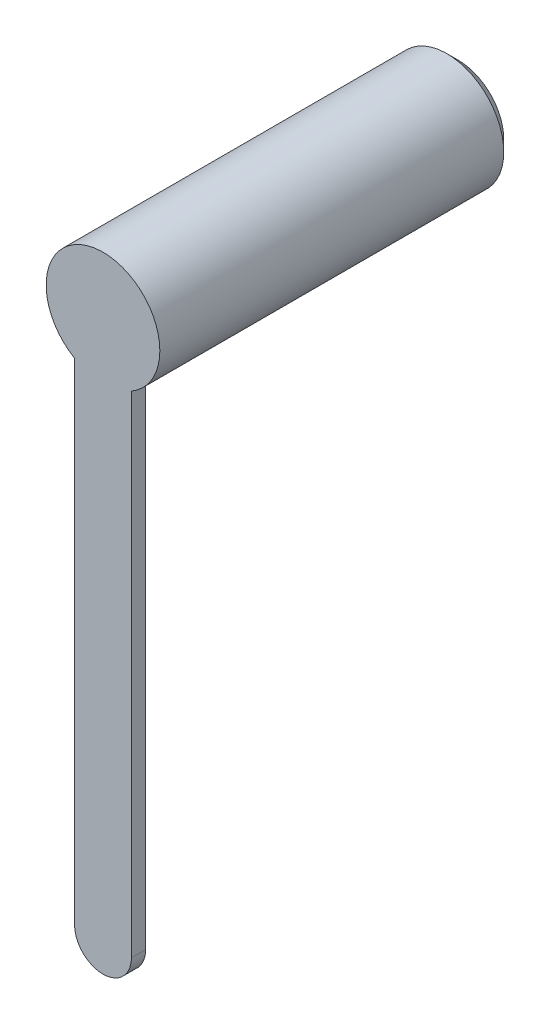
ISO-10303-21;
HEADER;
FILE_DESCRIPTION(('STEP AP214'),'2;1');
FILE_NAME('part.step','',(''),(''),'','','');
FILE_SCHEMA(('AUTOMOTIVE_DESIGN { 1 0 10303 214 1 1 1 1 }'));
ENDSEC;
DATA;
#1=APPLICATION_CONTEXT('core data for automotive mechanical design processes');
#2=APPLICATION_PROTOCOL_DEFINITION('international standard','automotive_design',2000,#1);
#3=PRODUCT_CONTEXT('',#1,'mechanical');
#4=PRODUCT('Part','Part','',(#3));
#5=PRODUCT_RELATED_PRODUCT_CATEGORY('part','',(#4));
#6=PRODUCT_DEFINITION_FORMATION('','',#4);
#7=PRODUCT_DEFINITION_CONTEXT('part definition',#1,'design');
#8=PRODUCT_DEFINITION('design','',#6,#7);
#9=PRODUCT_DEFINITION_SHAPE('','',#8);
#10=(LENGTH_UNIT() NAMED_UNIT(*) SI_UNIT(.MILLI.,.METRE.));
#11=(NAMED_UNIT(*) PLANE_ANGLE_UNIT() SI_UNIT($,.RADIAN.));
#12=(NAMED_UNIT(*) SI_UNIT($,.STERADIAN.) SOLID_ANGLE_UNIT());
#13=UNCERTAINTY_MEASURE_WITH_UNIT(LENGTH_MEASURE(1.E-05),#10,'distance_accuracy_value','');
#14=(GEOMETRIC_REPRESENTATION_CONTEXT(3) GLOBAL_UNCERTAINTY_ASSIGNED_CONTEXT((#13)) GLOBAL_UNIT_ASSIGNED_CONTEXT((#10,
#11,#12)) REPRESENTATION_CONTEXT('',''));
#15=CARTESIAN_POINT('',(0.,0.,0.));
#16=DIRECTION('',(0.,0.,1.));
#17=DIRECTION('',(1.,0.,0.));
#18=AXIS2_PLACEMENT_3D('',#15,#16,#17);
#19=CARTESIAN_POINT('',(0.,6.5,0.125));
#20=DIRECTION('',(0.,0.,1.));
#21=DIRECTION('',(1.,0.,0.));
#22=AXIS2_PLACEMENT_3D('',#19,#20,#21);
#23=PLANE('',#22);
#24=DIRECTION('',(0.,1.,0.));
#25=VECTOR('',#24,1.);
#26=CARTESIAN_POINT('',(0.500000000010001,-3.00000000001,0.12500000001));
#27=LINE('',#26,#25);
#28=CARTESIAN_POINT('',(0.5,-3.,0.125));
#29=VERTEX_POINT('',#28);
#30=CARTESIAN_POINT('',(0.5,5.63397459621556,0.125));
#31=VERTEX_POINT('',#30);
#32=EDGE_CURVE('E93',#29,#31,#27,.T.);
#33=ORIENTED_EDGE('',*,*,#32,.T.);
#34=CARTESIAN_POINT('',(0.,6.50000000001,0.12500000001));
#35=DIRECTION('',(0.,0.,1.));
#36=DIRECTION('',(1.,0.,0.));
#37=AXIS2_PLACEMENT_3D('',#34,#35,#36);
#38=CIRCLE('',#37,1.);
#39=CARTESIAN_POINT('',(-0.5,5.63397459621556,0.125));
#40=VERTEX_POINT('',#39);
#41=EDGE_CURVE('E90',#31,#40,#38,.T.);
#42=ORIENTED_EDGE('',*,*,#41,.T.);
#43=DIRECTION('',(0.,-1.,0.));
#44=VECTOR('',#43,1.);
#45=CARTESIAN_POINT('',(-0.500000000010001,5.63397459622556,0.12500000001));
#46=LINE('',#45,#44);
#47=CARTESIAN_POINT('',(-0.5,-3.,0.125));
#48=VERTEX_POINT('',#47);
#49=EDGE_CURVE('E91',#40,#48,#46,.T.);
#50=ORIENTED_EDGE('',*,*,#49,.T.);
#51=CARTESIAN_POINT('',(0.,-3.00000000001,0.12500000001));
#52=DIRECTION('',(0.,0.,1.));
#53=DIRECTION('',(1.,0.,0.));
#54=AXIS2_PLACEMENT_3D('',#51,#52,#53);
#55=CIRCLE('',#54,0.5);
#56=EDGE_CURVE('E11',#48,#29,#55,.T.);
#57=ORIENTED_EDGE('',*,*,#56,.T.);
#58=EDGE_LOOP('',(#33,#42,#50,#57));
#59=FACE_BOUND('',#58,.T.);
#60=ADVANCED_FACE('F17',(#59),#23,.T.);
#61=CARTESIAN_POINT('',(0.,-3.,0.125));
#62=DIRECTION('',(0.,0.,1.));
#63=DIRECTION('',(-1.,0.,0.));
#64=AXIS2_PLACEMENT_3D('',#61,#62,#63);
#65=CYLINDRICAL_SURFACE('',#64,0.5);
#66=CARTESIAN_POINT('',(0.,-3.00000000001,-0.12500000001));
#67=DIRECTION('',(0.,0.,1.));
#68=DIRECTION('',(1.,0.,0.));
#69=AXIS2_PLACEMENT_3D('',#66,#67,#68);
#70=CIRCLE('',#69,0.5);
#71=CARTESIAN_POINT('',(-0.5,-3.,-0.125));
#72=VERTEX_POINT('',#71);
#73=CARTESIAN_POINT('',(0.5,-3.,-0.125));
#74=VERTEX_POINT('',#73);
#75=EDGE_CURVE('E113',#72,#74,#70,.T.);
#76=ORIENTED_EDGE('',*,*,#75,.T.);
#77=DIRECTION('',(0.,0.,-1.));
#78=VECTOR('',#77,1.);
#79=CARTESIAN_POINT('',(0.500000000010001,-3.00000000001,0.12500000001));
#80=LINE('',#79,#78);
#81=EDGE_CURVE('E28',#29,#74,#80,.T.);
#82=ORIENTED_EDGE('',*,*,#81,.F.);
#83=ORIENTED_EDGE('',*,*,#56,.F.);
#84=DIRECTION('',(0.,0.,-1.));
#85=VECTOR('',#84,1.);
#86=CARTESIAN_POINT('',(-0.500000000010001,-3.00000000001,0.12500000001));
#87=LINE('',#86,#85);
#88=EDGE_CURVE('E72',#48,#72,#87,.T.);
#89=ORIENTED_EDGE('',*,*,#88,.T.);
#90=EDGE_LOOP('',(#76,#82,#83,#89));
#91=FACE_BOUND('',#90,.T.);
#92=ADVANCED_FACE('F184',(#91),#65,.T.);
#93=CARTESIAN_POINT('',(0.5,-3.,0.125));
#94=DIRECTION('',(-1.,0.,0.));
#95=DIRECTION('',(0.,0.,1.));
#96=AXIS2_PLACEMENT_3D('',#93,#94,#95);
#97=PLANE('',#96);
#98=DIRECTION('',(0.,1.,0.));
#99=VECTOR('',#98,1.);
#100=CARTESIAN_POINT('',(0.500000000010001,-3.00000000001,-0.12500000001));
#101=LINE('',#100,#99);
#102=CARTESIAN_POINT('',(0.5,5.63397459621556,-0.125));
#103=VERTEX_POINT('',#102);
#104=EDGE_CURVE('E117',#74,#103,#101,.T.);
#105=ORIENTED_EDGE('',*,*,#104,.T.);
#106=DIRECTION('',(0.,0.,-1.));
#107=VECTOR('',#106,1.);
#108=CARTESIAN_POINT('',(0.500000000010001,5.63397459622556,0.12500000001));
#109=LINE('',#108,#107);
#110=EDGE_CURVE('E97',#31,#103,#109,.T.);
#111=ORIENTED_EDGE('',*,*,#110,.F.);
#112=ORIENTED_EDGE('',*,*,#32,.F.);
#113=ORIENTED_EDGE('',*,*,#81,.T.);
#114=EDGE_LOOP('',(#105,#111,#112,#113));
#115=FACE_BOUND('',#114,.T.);
#116=ADVANCED_FACE('F180',(#115),#97,.F.);
#117=CARTESIAN_POINT('',(0.,6.5,-0.125));
#118=DIRECTION('',(0.,0.,-1.));
#119=DIRECTION('',(1.,0.,0.));
#120=AXIS2_PLACEMENT_3D('',#117,#118,#119);
#121=CYLINDRICAL_SURFACE('',#120,1.);
#122=ORIENTED_EDGE('',*,*,#41,.F.);
#123=ORIENTED_EDGE('',*,*,#110,.T.);
#124=CARTESIAN_POINT('',(0.,6.50000000001,-0.12500000001));
#125=DIRECTION('',(0.,0.,1.));
#126=DIRECTION('',(1.,0.,0.));
#127=AXIS2_PLACEMENT_3D('',#124,#125,#126);
#128=CIRCLE('',#127,1.);
#129=CARTESIAN_POINT('',(-0.5,5.63397459621556,-0.125));
#130=VERTEX_POINT('',#129);
#131=EDGE_CURVE('E101',#130,#103,#128,.T.);
#132=ORIENTED_EDGE('',*,*,#131,.F.);
#133=DIRECTION('',(0.,0.,-1.));
#134=VECTOR('',#133,1.);
#135=CARTESIAN_POINT('',(-0.500000000010001,5.63397459622556,0.12500000001));
#136=LINE('',#135,#134);
#137=EDGE_CURVE('E60',#40,#130,#136,.T.);
#138=ORIENTED_EDGE('',*,*,#137,.F.);
#139=EDGE_LOOP('',(#122,#123,#132,#138));
#140=FACE_BOUND('',#139,.T.);
#141=CARTESIAN_POINT('',(0.,6.50000000001,-5.92500000001));
#142=DIRECTION('',(0.,0.,1.));
#143=DIRECTION('',(1.,0.,0.));
#144=AXIS2_PLACEMENT_3D('',#141,#142,#143);
#145=CIRCLE('',#144,1.);
#146=CARTESIAN_POINT('',(1.00000000001,6.50000000001,-5.92500000001));
#147=VERTEX_POINT('',#146);
#148=EDGE_CURVE('E21',#147,#147,#145,.T.);
#149=ORIENTED_EDGE('',*,*,#148,.T.);
#150=EDGE_LOOP('',(#149));
#151=FACE_BOUND('',#150,.T.);
#152=ADVANCED_FACE('F19',(#140,#151),#121,.T.);
#153=CARTESIAN_POINT('',(0.,6.5,-5.925));
#154=DIRECTION('',(0.,0.,1.));
#155=DIRECTION('',(1.,0.,0.));
#156=AXIS2_PLACEMENT_3D('',#153,#154,#155);
#157=CONICAL_SURFACE('',#156,1.,0.7853981634);
#158=CARTESIAN_POINT('',(0.,6.50000000001,-6.12500000001));
#159=DIRECTION('',(0.,0.,1.));
#160=DIRECTION('',(1.,0.,0.));
#161=AXIS2_PLACEMENT_3D('',#158,#159,#160);
#162=CIRCLE('',#161,0.8);
#163=CARTESIAN_POINT('',(0.800000000010001,6.50000000001,-6.12500000001));
#164=VERTEX_POINT('',#163);
#165=EDGE_CURVE('E104',#164,#164,#162,.T.);
#166=ORIENTED_EDGE('',*,*,#165,.T.);
#167=EDGE_LOOP('',(#166));
#168=FACE_BOUND('',#167,.T.);
#169=ORIENTED_EDGE('',*,*,#148,.F.);
#170=EDGE_LOOP('',(#169));
#171=FACE_BOUND('',#170,.T.);
#172=ADVANCED_FACE('F224',(#168,#171),#157,.T.);
#173=CARTESIAN_POINT('',(0.,6.5,-6.125));
#174=DIRECTION('',(0.,0.,-1.));
#175=DIRECTION('',(0.,-1.,0.));
#176=AXIS2_PLACEMENT_3D('',#173,#174,#175);
#177=PLANE('',#176);
#178=ORIENTED_EDGE('',*,*,#165,.F.);
#179=EDGE_LOOP('',(#178));
#180=FACE_BOUND('',#179,.T.);
#181=ADVANCED_FACE('F209',(#180),#177,.T.);
#182=CARTESIAN_POINT('',(-0.5,5.63397459621556,0.125));
#183=DIRECTION('',(1.,0.,0.));
#184=DIRECTION('',(0.,1.,0.));
#185=AXIS2_PLACEMENT_3D('',#182,#183,#184);
#186=PLANE('',#185);
#187=DIRECTION('',(0.,-1.,0.));
#188=VECTOR('',#187,1.);
#189=CARTESIAN_POINT('',(-0.500000000010001,5.63397459622556,-0.12500000001));
#190=LINE('',#189,#188);
#191=EDGE_CURVE('E127',#130,#72,#190,.T.);
#192=ORIENTED_EDGE('',*,*,#191,.T.);
#193=ORIENTED_EDGE('',*,*,#88,.F.);
#194=ORIENTED_EDGE('',*,*,#49,.F.);
#195=ORIENTED_EDGE('',*,*,#137,.T.);
#196=EDGE_LOOP('',(#192,#193,#194,#195));
#197=FACE_BOUND('',#196,.T.);
#198=ADVANCED_FACE('F106',(#197),#186,.F.);
#199=CARTESIAN_POINT('',(0.,6.5,-0.125));
#200=DIRECTION('',(0.,0.,1.));
#201=DIRECTION('',(1.,0.,0.));
#202=AXIS2_PLACEMENT_3D('',#199,#200,#201);
#203=PLANE('',#202);
#204=ORIENTED_EDGE('',*,*,#191,.F.);
#205=ORIENTED_EDGE('',*,*,#131,.T.);
#206=ORIENTED_EDGE('',*,*,#104,.F.);
#207=ORIENTED_EDGE('',*,*,#75,.F.);
#208=EDGE_LOOP('',(#204,#205,#206,#207));
#209=FACE_BOUND('',#208,.T.);
#210=ADVANCED_FACE('F197',(#209),#203,.F.);
#211=CLOSED_SHELL('',(#60,#92,#116,#152,#172,#181,#198,#210));
#212=MANIFOLD_SOLID_BREP('B1',#211);
#213=ADVANCED_BREP_SHAPE_REPRESENTATION('',(#18,#212),#14);
#214=SHAPE_DEFINITION_REPRESENTATION(#9,#213);
ENDSEC;
END-ISO-10303-21;
